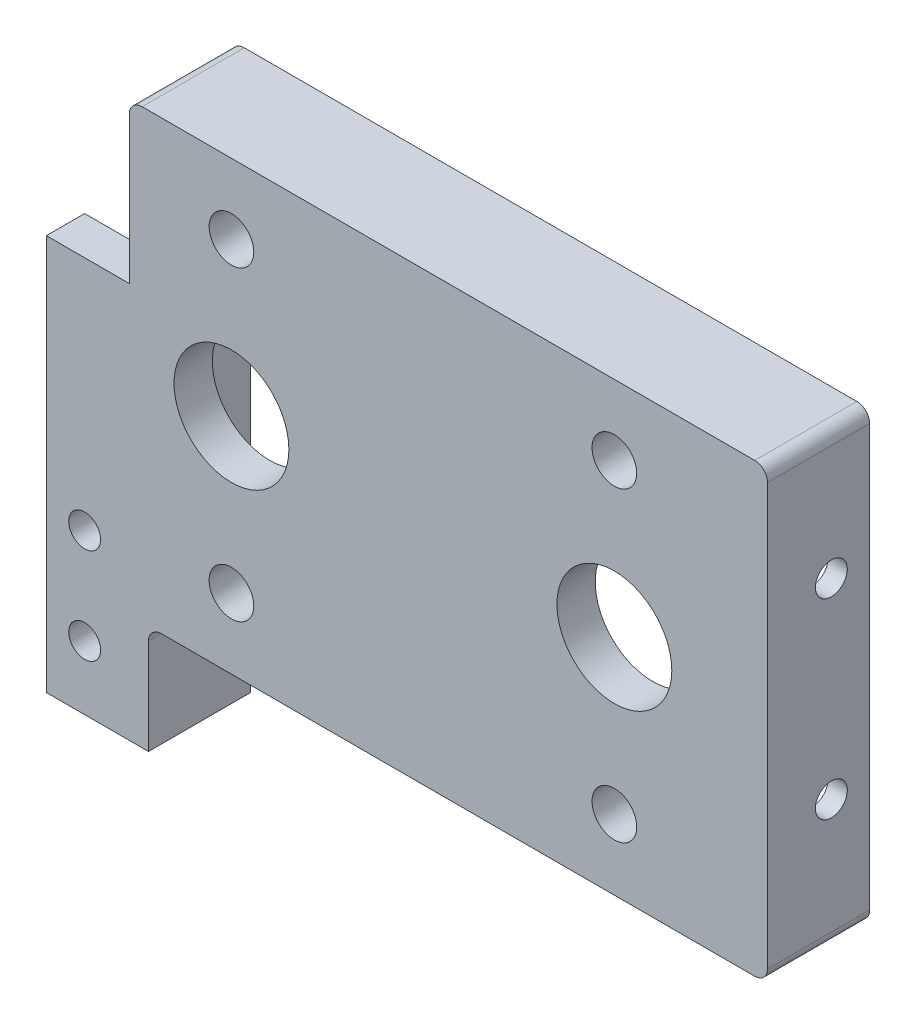
ISO-10303-21;
HEADER;
FILE_DESCRIPTION(('STEP AP214'),'2;1');
FILE_NAME('part.step','',(''),(''),'','','');
FILE_SCHEMA(('AUTOMOTIVE_DESIGN { 1 0 10303 214 1 1 1 1 }'));
ENDSEC;
DATA;
#1=APPLICATION_CONTEXT('core data for automotive mechanical design processes');
#2=APPLICATION_PROTOCOL_DEFINITION('international standard','automotive_design',2000,#1);
#3=PRODUCT_CONTEXT('',#1,'mechanical');
#4=PRODUCT('Part','Part','',(#3));
#5=PRODUCT_RELATED_PRODUCT_CATEGORY('part','',(#4));
#6=PRODUCT_DEFINITION_FORMATION('','',#4);
#7=PRODUCT_DEFINITION_CONTEXT('part definition',#1,'design');
#8=PRODUCT_DEFINITION('design','',#6,#7);
#9=PRODUCT_DEFINITION_SHAPE('','',#8);
#10=(LENGTH_UNIT() NAMED_UNIT(*) SI_UNIT(.MILLI.,.METRE.));
#11=(NAMED_UNIT(*) PLANE_ANGLE_UNIT() SI_UNIT($,.RADIAN.));
#12=(NAMED_UNIT(*) SI_UNIT($,.STERADIAN.) SOLID_ANGLE_UNIT());
#13=UNCERTAINTY_MEASURE_WITH_UNIT(LENGTH_MEASURE(1.E-05),#10,'distance_accuracy_value','');
#14=(GEOMETRIC_REPRESENTATION_CONTEXT(3) GLOBAL_UNCERTAINTY_ASSIGNED_CONTEXT((#13)) GLOBAL_UNIT_ASSIGNED_CONTEXT((#10,
#11,#12)) REPRESENTATION_CONTEXT('',''));
#15=CARTESIAN_POINT('',(0.,0.,0.));
#16=DIRECTION('',(0.,0.,1.));
#17=DIRECTION('',(1.,0.,0.));
#18=AXIS2_PLACEMENT_3D('',#15,#16,#17);
#19=CARTESIAN_POINT('',(-48.6575342465754,-47.7671232876712,-10.));
#20=DIRECTION('',(-1.,0.,0.));
#21=DIRECTION('',(0.,0.,1.));
#22=AXIS2_PLACEMENT_3D('',#19,#20,#21);
#23=PLANE('',#22);
#24=DIRECTION('',(0.,-1.,0.));
#25=VECTOR('',#24,1.);
#26=CARTESIAN_POINT('',(-48.6575342465754,-47.7671232876712,-10.));
#27=LINE('',#26,#25);
#28=CARTESIAN_POINT('',(-48.6575342465754,-52.7671232876713,-10.));
#29=VERTEX_POINT('',#28);
#30=CARTESIAN_POINT('',(-48.6575342465754,-67.7671232876712,-10.));
#31=VERTEX_POINT('',#30);
#32=EDGE_CURVE('E273',#29,#31,#27,.T.);
#33=ORIENTED_EDGE('',*,*,#32,.F.);
#34=DIRECTION('',(0.,0.,-1.));
#35=VECTOR('',#34,1.);
#36=CARTESIAN_POINT('',(-48.6575342465754,-52.7671232876713,6.));
#37=LINE('',#36,#35);
#38=CARTESIAN_POINT('',(-48.6575342465754,-52.7671232876713,6.));
#39=VERTEX_POINT('',#38);
#40=EDGE_CURVE('E403',#29,#39,#37,.F.);
#41=ORIENTED_EDGE('',*,*,#40,.T.);
#42=DIRECTION('',(0.,1.,0.));
#43=VECTOR('',#42,1.);
#44=CARTESIAN_POINT('',(-48.6575342465754,-67.7671232876712,6.));
#45=LINE('',#44,#43);
#46=CARTESIAN_POINT('',(-48.6575342465754,-67.7671232876712,6.));
#47=VERTEX_POINT('',#46);
#48=EDGE_CURVE('E263',#47,#39,#45,.T.);
#49=ORIENTED_EDGE('',*,*,#48,.F.);
#50=DIRECTION('',(0.,0.,1.));
#51=VECTOR('',#50,1.);
#52=CARTESIAN_POINT('',(-48.6575342465754,-67.7671232876712,-10.));
#53=LINE('',#52,#51);
#54=EDGE_CURVE('E297',#31,#47,#53,.T.);
#55=ORIENTED_EDGE('',*,*,#54,.F.);
#56=EDGE_LOOP('',(#33,#41,#49,#55));
#57=FACE_BOUND('',#56,.T.);
#58=ADVANCED_FACE('F39',(#57),#23,.F.);
#59=CARTESIAN_POINT('',(0.,0.,0.));
#60=DIRECTION('',(0.,0.,1.));
#61=DIRECTION('',(1.,0.,0.));
#62=AXIS2_PLACEMENT_3D('',#59,#60,#61);
#63=PLANE('',#62);
#64=CARTESIAN_POINT('',(-35.6575342465754,-15.7671232876712,0.));
#65=DIRECTION('',(0.,0.,1.));
#66=DIRECTION('',(1.,0.,0.));
#67=AXIS2_PLACEMENT_3D('',#64,#65,#66);
#68=CIRCLE('',#67,9.);
#69=CARTESIAN_POINT('',(-26.6575342465754,-15.7671232876712,0.));
#70=VERTEX_POINT('',#69);
#71=EDGE_CURVE('E326',#70,#70,#68,.T.);
#72=ORIENTED_EDGE('',*,*,#71,.T.);
#73=EDGE_LOOP('',(#72));
#74=FACE_BOUND('',#73,.T.);
#75=CARTESIAN_POINT('',(-35.6575342465754,8.23287671232875,0.));
#76=DIRECTION('',(0.,0.,1.));
#77=DIRECTION('',(1.,0.,0.));
#78=AXIS2_PLACEMENT_3D('',#75,#76,#77);
#79=CIRCLE('',#78,3.5);
#80=CARTESIAN_POINT('',(-32.1575342465754,8.23287671232875,0.));
#81=VERTEX_POINT('',#80);
#82=EDGE_CURVE('E342',#81,#81,#79,.T.);
#83=ORIENTED_EDGE('',*,*,#82,.T.);
#84=EDGE_LOOP('',(#83));
#85=FACE_BOUND('',#84,.T.);
#86=CARTESIAN_POINT('',(-35.6575342465749,-39.7671232876712,0.));
#87=DIRECTION('',(0.,0.,1.));
#88=DIRECTION('',(1.,0.,0.));
#89=AXIS2_PLACEMENT_3D('',#86,#87,#88);
#90=CIRCLE('',#89,3.5);
#91=CARTESIAN_POINT('',(-32.1575342465749,-39.7671232876712,0.));
#92=VERTEX_POINT('',#91);
#93=EDGE_CURVE('E332',#92,#92,#90,.T.);
#94=ORIENTED_EDGE('',*,*,#93,.T.);
#95=EDGE_LOOP('',(#94));
#96=FACE_BOUND('',#95,.T.);
#97=CARTESIAN_POINT('',(24.3424657534246,-15.7671232876712,0.));
#98=DIRECTION('',(0.,0.,1.));
#99=DIRECTION('',(1.,0.,0.));
#100=AXIS2_PLACEMENT_3D('',#97,#98,#99);
#101=CIRCLE('',#100,9.);
#102=CARTESIAN_POINT('',(33.3424657534246,-15.7671232876712,0.));
#103=VERTEX_POINT('',#102);
#104=EDGE_CURVE('E312',#103,#103,#101,.T.);
#105=ORIENTED_EDGE('',*,*,#104,.T.);
#106=EDGE_LOOP('',(#105));
#107=FACE_BOUND('',#106,.T.);
#108=CARTESIAN_POINT('',(24.3424657534246,8.23287671232875,0.));
#109=DIRECTION('',(0.,0.,1.));
#110=DIRECTION('',(1.,0.,0.));
#111=AXIS2_PLACEMENT_3D('',#108,#109,#110);
#112=CIRCLE('',#111,3.5);
#113=CARTESIAN_POINT('',(27.8424657534246,8.23287671232875,0.));
#114=VERTEX_POINT('',#113);
#115=EDGE_CURVE('E352',#114,#114,#112,.T.);
#116=ORIENTED_EDGE('',*,*,#115,.T.);
#117=EDGE_LOOP('',(#116));
#118=FACE_BOUND('',#117,.T.);
#119=CARTESIAN_POINT('',(24.3424657534251,-39.7671232876712,0.));
#120=DIRECTION('',(0.,0.,1.));
#121=DIRECTION('',(1.,0.,0.));
#122=AXIS2_PLACEMENT_3D('',#119,#120,#121);
#123=CIRCLE('',#122,3.5);
#124=CARTESIAN_POINT('',(27.8424657534251,-39.7671232876712,0.));
#125=VERTEX_POINT('',#124);
#126=EDGE_CURVE('E322',#125,#125,#123,.T.);
#127=ORIENTED_EDGE('',*,*,#126,.T.);
#128=EDGE_LOOP('',(#127));
#129=FACE_BOUND('',#128,.T.);
#130=DIRECTION('',(0.,-1.,0.));
#131=VECTOR('',#130,1.);
#132=CARTESIAN_POINT('',(-48.6575342465754,-47.7671232876712,0.));
#133=LINE('',#132,#131);
#134=CARTESIAN_POINT('',(-48.6575342465754,16.2328767123288,0.));
#135=VERTEX_POINT('',#134);
#136=CARTESIAN_POINT('',(-48.6575342465754,-47.7671232876712,0.));
#137=VERTEX_POINT('',#136);
#138=EDGE_CURVE('E267',#135,#137,#133,.T.);
#139=ORIENTED_EDGE('',*,*,#138,.F.);
#140=DIRECTION('',(-1.,0.,0.));
#141=VECTOR('',#140,1.);
#142=CARTESIAN_POINT('',(-54.6575342465754,16.2328767123288,0.));
#143=LINE('',#142,#141);
#144=CARTESIAN_POINT('',(45.3424657534246,16.2328767123288,0.));
#145=VERTEX_POINT('',#144);
#146=EDGE_CURVE('E286',#145,#135,#143,.T.);
#147=ORIENTED_EDGE('',*,*,#146,.F.);
#148=DIRECTION('',(0.,1.,0.));
#149=VECTOR('',#148,1.);
#150=CARTESIAN_POINT('',(45.3424657534246,16.2328767123288,0.));
#151=LINE('',#150,#149);
#152=CARTESIAN_POINT('',(45.3424657534246,-47.7671232876712,0.));
#153=VERTEX_POINT('',#152);
#154=EDGE_CURVE('E331',#153,#145,#151,.T.);
#155=ORIENTED_EDGE('',*,*,#154,.F.);
#156=DIRECTION('',(1.,0.,0.));
#157=VECTOR('',#156,1.);
#158=CARTESIAN_POINT('',(-54.6575342465754,-47.7671232876712,0.));
#159=LINE('',#158,#157);
#160=EDGE_CURVE('E327',#137,#153,#159,.T.);
#161=ORIENTED_EDGE('',*,*,#160,.F.);
#162=EDGE_LOOP('',(#139,#147,#155,#161));
#163=FACE_BOUND('',#162,.T.);
#164=ADVANCED_FACE('F484',(#74,#85,#96,#107,#118,#129,#163),#63,.F.);
#165=CARTESIAN_POINT('',(-58.6575342465754,-42.7671232876712,0.));
#166=DIRECTION('',(0.,0.,-1.));
#167=DIRECTION('',(-1.,0.,0.));
#168=AXIS2_PLACEMENT_3D('',#165,#166,#167);
#169=CIRCLE('',#168,2.5);
#170=CARTESIAN_POINT('',(-61.1575342465754,-42.7671232876712,0.));
#171=VERTEX_POINT('',#170);
#172=EDGE_CURVE('E363',#171,#171,#169,.T.);
#173=ORIENTED_EDGE('',*,*,#172,.F.);
#174=EDGE_LOOP('',(#173));
#175=FACE_BOUND('',#174,.T.);
#176=CARTESIAN_POINT('',(-58.6575342465754,-57.7671232876712,0.));
#177=DIRECTION('',(0.,0.,-1.));
#178=DIRECTION('',(-1.,0.,0.));
#179=AXIS2_PLACEMENT_3D('',#176,#177,#178);
#180=CIRCLE('',#179,2.5);
#181=CARTESIAN_POINT('',(-61.1575342465754,-57.7671232876712,0.));
#182=VERTEX_POINT('',#181);
#183=EDGE_CURVE('E197',#182,#182,#180,.T.);
#184=ORIENTED_EDGE('',*,*,#183,.F.);
#185=EDGE_LOOP('',(#184));
#186=FACE_BOUND('',#185,.T.);
#187=DIRECTION('',(1.,0.,0.));
#188=VECTOR('',#187,1.);
#189=CARTESIAN_POINT('',(-54.6575342465754,-67.7671232876712,0.));
#190=LINE('',#189,#188);
#191=CARTESIAN_POINT('',(-64.6575342465754,-67.7671232876712,0.));
#192=VERTEX_POINT('',#191);
#193=CARTESIAN_POINT('',(-51.6575342465754,-67.7671232876712,0.));
#194=VERTEX_POINT('',#193);
#195=EDGE_CURVE('E256',#192,#194,#190,.T.);
#196=ORIENTED_EDGE('',*,*,#195,.F.);
#197=DIRECTION('',(0.,-1.,0.));
#198=VECTOR('',#197,1.);
#199=CARTESIAN_POINT('',(-64.6575342465754,-5.76712328767124,0.));
#200=LINE('',#199,#198);
#201=CARTESIAN_POINT('',(-64.6575342465754,-5.76712328767124,0.));
#202=VERTEX_POINT('',#201);
#203=EDGE_CURVE('E186',#202,#192,#200,.T.);
#204=ORIENTED_EDGE('',*,*,#203,.F.);
#205=DIRECTION('',(-1.,0.,0.));
#206=VECTOR('',#205,1.);
#207=CARTESIAN_POINT('',(-51.6575342465754,-5.76712328767124,0.));
#208=LINE('',#207,#206);
#209=CARTESIAN_POINT('',(-51.6575342465754,-5.76712328767124,0.));
#210=VERTEX_POINT('',#209);
#211=EDGE_CURVE('E176',#210,#202,#208,.T.);
#212=ORIENTED_EDGE('',*,*,#211,.F.);
#213=DIRECTION('',(0.,1.,0.));
#214=VECTOR('',#213,1.);
#215=CARTESIAN_POINT('',(-51.6575342465754,-47.7671232876712,0.));
#216=LINE('',#215,#214);
#217=EDGE_CURVE('E281',#194,#210,#216,.T.);
#218=ORIENTED_EDGE('',*,*,#217,.F.);
#219=EDGE_LOOP('',(#196,#204,#212,#218));
#220=FACE_BOUND('',#219,.T.);
#221=ADVANCED_FACE('F457',(#175,#186,#220),#63,.F.);
#222=CARTESIAN_POINT('',(0.,0.,6.));
#223=DIRECTION('',(0.,0.,1.));
#224=DIRECTION('',(1.,0.,0.));
#225=AXIS2_PLACEMENT_3D('',#222,#223,#224);
#226=PLANE('',#225);
#227=CARTESIAN_POINT('',(-58.6575342465754,-42.7671232876712,6.));
#228=DIRECTION('',(0.,0.,1.));
#229=DIRECTION('',(1.,0.,0.));
#230=AXIS2_PLACEMENT_3D('',#227,#228,#229);
#231=CIRCLE('',#230,2.5);
#232=CARTESIAN_POINT('',(-56.1575342465754,-42.7671232876712,6.));
#233=VERTEX_POINT('',#232);
#234=EDGE_CURVE('E359',#233,#233,#231,.T.);
#235=ORIENTED_EDGE('',*,*,#234,.F.);
#236=EDGE_LOOP('',(#235));
#237=FACE_BOUND('',#236,.T.);
#238=CARTESIAN_POINT('',(-58.6575342465754,-57.7671232876712,6.));
#239=DIRECTION('',(0.,0.,1.));
#240=DIRECTION('',(1.,0.,0.));
#241=AXIS2_PLACEMENT_3D('',#238,#239,#240);
#242=CIRCLE('',#241,2.5);
#243=CARTESIAN_POINT('',(-56.1575342465754,-57.7671232876712,6.));
#244=VERTEX_POINT('',#243);
#245=EDGE_CURVE('E193',#244,#244,#242,.T.);
#246=ORIENTED_EDGE('',*,*,#245,.F.);
#247=EDGE_LOOP('',(#246));
#248=FACE_BOUND('',#247,.T.);
#249=DIRECTION('',(-1.,0.,0.));
#250=VECTOR('',#249,1.);
#251=CARTESIAN_POINT('',(45.3424657534246,19.2328767123288,6.));
#252=LINE('',#251,#250);
#253=CARTESIAN_POINT('',(46.3424657534246,19.2328767123288,6.));
#254=VERTEX_POINT('',#253);
#255=CARTESIAN_POINT('',(-49.6575342465753,19.2328767123288,6.));
#256=VERTEX_POINT('',#255);
#257=EDGE_CURVE('E218',#254,#256,#252,.T.);
#258=ORIENTED_EDGE('',*,*,#257,.T.);
#259=CARTESIAN_POINT('',(-49.6575342465754,17.2328767123288,6.));
#260=DIRECTION('',(0.,0.,1.));
#261=DIRECTION('',(1.,0.,0.));
#262=AXIS2_PLACEMENT_3D('',#259,#260,#261);
#263=CIRCLE('',#262,2.);
#264=CARTESIAN_POINT('',(-51.6575342465754,17.2328767123288,6.));
#265=VERTEX_POINT('',#264);
#266=EDGE_CURVE('E386',#256,#265,#263,.T.);
#267=ORIENTED_EDGE('',*,*,#266,.T.);
#268=DIRECTION('',(0.,1.,0.));
#269=VECTOR('',#268,1.);
#270=CARTESIAN_POINT('',(-51.6575342465754,16.2328767123288,6.));
#271=LINE('',#270,#269);
#272=CARTESIAN_POINT('',(-51.6575342465754,-5.76712328767124,6.));
#273=VERTEX_POINT('',#272);
#274=EDGE_CURVE('E171',#273,#265,#271,.T.);
#275=ORIENTED_EDGE('',*,*,#274,.F.);
#276=DIRECTION('',(-1.,0.,0.));
#277=VECTOR('',#276,1.);
#278=CARTESIAN_POINT('',(-51.6575342465754,-5.76712328767124,6.));
#279=LINE('',#278,#277);
#280=CARTESIAN_POINT('',(-64.6575342465754,-5.76712328767124,6.));
#281=VERTEX_POINT('',#280);
#282=EDGE_CURVE('E162',#273,#281,#279,.T.);
#283=ORIENTED_EDGE('',*,*,#282,.T.);
#284=DIRECTION('',(0.,1.,0.));
#285=VECTOR('',#284,1.);
#286=CARTESIAN_POINT('',(-64.6575342465754,-5.76712328767124,6.));
#287=LINE('',#286,#285);
#288=CARTESIAN_POINT('',(-64.6575342465754,-67.7671232876712,6.));
#289=VERTEX_POINT('',#288);
#290=EDGE_CURVE('E169',#289,#281,#287,.T.);
#291=ORIENTED_EDGE('',*,*,#290,.F.);
#292=DIRECTION('',(-1.,0.,0.));
#293=VECTOR('',#292,1.);
#294=CARTESIAN_POINT('',(-54.6575342465754,-67.7671232876712,6.));
#295=LINE('',#294,#293);
#296=EDGE_CURVE('E260',#47,#289,#295,.T.);
#297=ORIENTED_EDGE('',*,*,#296,.F.);
#298=ORIENTED_EDGE('',*,*,#48,.T.);
#299=CARTESIAN_POINT('',(-46.6575342465754,-52.7671232876713,6.));
#300=DIRECTION('',(0.,0.,1.));
#301=DIRECTION('',(1.,0.,0.));
#302=AXIS2_PLACEMENT_3D('',#299,#300,#301);
#303=CIRCLE('',#302,2.);
#304=CARTESIAN_POINT('',(-46.6575342465753,-50.7671232876713,6.));
#305=VERTEX_POINT('',#304);
#306=EDGE_CURVE('E11',#39,#305,#303,.F.);
#307=ORIENTED_EDGE('',*,*,#306,.T.);
#308=DIRECTION('',(-1.,0.,0.));
#309=VECTOR('',#308,1.);
#310=CARTESIAN_POINT('',(45.3424657534246,-50.7671232876713,6.));
#311=LINE('',#310,#309);
#312=CARTESIAN_POINT('',(46.3424657534246,-50.7671232876713,6.));
#313=VERTEX_POINT('',#312);
#314=EDGE_CURVE('E238',#313,#305,#311,.T.);
#315=ORIENTED_EDGE('',*,*,#314,.F.);
#316=CARTESIAN_POINT('',(46.3424657534246,-48.7671232876713,6.));
#317=DIRECTION('',(0.,0.,1.));
#318=DIRECTION('',(1.,0.,0.));
#319=AXIS2_PLACEMENT_3D('',#316,#317,#318);
#320=CIRCLE('',#319,2.);
#321=CARTESIAN_POINT('',(48.3424657534246,-48.7671232876713,6.));
#322=VERTEX_POINT('',#321);
#323=EDGE_CURVE('E57',#313,#322,#320,.T.);
#324=ORIENTED_EDGE('',*,*,#323,.T.);
#325=DIRECTION('',(0.,-1.,0.));
#326=VECTOR('',#325,1.);
#327=CARTESIAN_POINT('',(48.3424657534246,19.2328767123288,6.));
#328=LINE('',#327,#326);
#329=CARTESIAN_POINT('',(48.3424657534246,17.2328767123288,6.));
#330=VERTEX_POINT('',#329);
#331=EDGE_CURVE('E211',#330,#322,#328,.T.);
#332=ORIENTED_EDGE('',*,*,#331,.F.);
#333=CARTESIAN_POINT('',(46.3424657534246,17.2328767123288,6.));
#334=DIRECTION('',(0.,0.,1.));
#335=DIRECTION('',(1.,0.,0.));
#336=AXIS2_PLACEMENT_3D('',#333,#334,#335);
#337=CIRCLE('',#336,2.);
#338=EDGE_CURVE('E65',#330,#254,#337,.T.);
#339=ORIENTED_EDGE('',*,*,#338,.T.);
#340=EDGE_LOOP('',(#258,#267,#275,#283,#291,#297,#298,#307,#315,#324,#332,#339));
#341=FACE_BOUND('',#340,.T.);
#342=CARTESIAN_POINT('',(24.3424657534251,-39.7671232876712,6.));
#343=DIRECTION('',(0.,0.,1.));
#344=DIRECTION('',(1.,0.,0.));
#345=AXIS2_PLACEMENT_3D('',#342,#343,#344);
#346=CIRCLE('',#345,3.5);
#347=CARTESIAN_POINT('',(27.8424657534251,-39.7671232876712,6.));
#348=VERTEX_POINT('',#347);
#349=EDGE_CURVE('E300',#348,#348,#346,.T.);
#350=ORIENTED_EDGE('',*,*,#349,.F.);
#351=EDGE_LOOP('',(#350));
#352=FACE_BOUND('',#351,.T.);
#353=CARTESIAN_POINT('',(24.3424657534246,8.23287671232875,6.));
#354=DIRECTION('',(0.,0.,1.));
#355=DIRECTION('',(1.,0.,0.));
#356=AXIS2_PLACEMENT_3D('',#353,#354,#355);
#357=CIRCLE('',#356,3.5);
#358=CARTESIAN_POINT('',(27.8424657534246,8.23287671232875,6.));
#359=VERTEX_POINT('',#358);
#360=EDGE_CURVE('E301',#359,#359,#357,.T.);
#361=ORIENTED_EDGE('',*,*,#360,.F.);
#362=EDGE_LOOP('',(#361));
#363=FACE_BOUND('',#362,.T.);
#364=CARTESIAN_POINT('',(24.3424657534246,-15.7671232876712,6.));
#365=DIRECTION('',(0.,0.,1.));
#366=DIRECTION('',(1.,0.,0.));
#367=AXIS2_PLACEMENT_3D('',#364,#365,#366);
#368=CIRCLE('',#367,9.);
#369=CARTESIAN_POINT('',(33.3424657534246,-15.7671232876712,6.));
#370=VERTEX_POINT('',#369);
#371=EDGE_CURVE('E305',#370,#370,#368,.T.);
#372=ORIENTED_EDGE('',*,*,#371,.F.);
#373=EDGE_LOOP('',(#372));
#374=FACE_BOUND('',#373,.T.);
#375=CARTESIAN_POINT('',(-35.6575342465749,-39.7671232876712,6.));
#376=DIRECTION('',(0.,0.,1.));
#377=DIRECTION('',(1.,0.,0.));
#378=AXIS2_PLACEMENT_3D('',#375,#376,#377);
#379=CIRCLE('',#378,3.5);
#380=CARTESIAN_POINT('',(-32.1575342465749,-39.7671232876712,6.));
#381=VERTEX_POINT('',#380);
#382=EDGE_CURVE('E318',#381,#381,#379,.T.);
#383=ORIENTED_EDGE('',*,*,#382,.F.);
#384=EDGE_LOOP('',(#383));
#385=FACE_BOUND('',#384,.T.);
#386=CARTESIAN_POINT('',(-35.6575342465754,8.23287671232875,6.));
#387=DIRECTION('',(0.,0.,1.));
#388=DIRECTION('',(1.,0.,0.));
#389=AXIS2_PLACEMENT_3D('',#386,#387,#388);
#390=CIRCLE('',#389,3.5);
#391=CARTESIAN_POINT('',(-32.1575342465754,8.23287671232875,6.));
#392=VERTEX_POINT('',#391);
#393=EDGE_CURVE('E313',#392,#392,#390,.T.);
#394=ORIENTED_EDGE('',*,*,#393,.F.);
#395=EDGE_LOOP('',(#394));
#396=FACE_BOUND('',#395,.T.);
#397=CARTESIAN_POINT('',(-35.6575342465754,-15.7671232876712,6.));
#398=DIRECTION('',(0.,0.,1.));
#399=DIRECTION('',(1.,0.,0.));
#400=AXIS2_PLACEMENT_3D('',#397,#398,#399);
#401=CIRCLE('',#400,9.);
#402=CARTESIAN_POINT('',(-26.6575342465754,-15.7671232876712,6.));
#403=VERTEX_POINT('',#402);
#404=EDGE_CURVE('E317',#403,#403,#401,.T.);
#405=ORIENTED_EDGE('',*,*,#404,.F.);
#406=EDGE_LOOP('',(#405));
#407=FACE_BOUND('',#406,.T.);
#408=ADVANCED_FACE('F165',(#237,#248,#341,#352,#363,#374,#385,#396,#407),#226,.T.);
#409=CARTESIAN_POINT('',(-35.6575342465754,-15.7671232876712,-4.));
#410=DIRECTION('',(0.,0.,1.));
#411=DIRECTION('',(1.,0.,0.));
#412=AXIS2_PLACEMENT_3D('',#409,#410,#411);
#413=CYLINDRICAL_SURFACE('',#412,9.);
#414=ORIENTED_EDGE('',*,*,#404,.T.);
#415=EDGE_LOOP('',(#414));
#416=FACE_BOUND('',#415,.T.);
#417=ORIENTED_EDGE('',*,*,#71,.F.);
#418=EDGE_LOOP('',(#417));
#419=FACE_BOUND('',#418,.T.);
#420=ADVANCED_FACE('F617',(#416,#419),#413,.F.);
#421=CARTESIAN_POINT('',(-35.6575342465754,8.23287671232875,-4.));
#422=DIRECTION('',(0.,0.,1.));
#423=DIRECTION('',(1.,0.,0.));
#424=AXIS2_PLACEMENT_3D('',#421,#422,#423);
#425=CYLINDRICAL_SURFACE('',#424,3.5);
#426=ORIENTED_EDGE('',*,*,#393,.T.);
#427=EDGE_LOOP('',(#426));
#428=FACE_BOUND('',#427,.T.);
#429=ORIENTED_EDGE('',*,*,#82,.F.);
#430=EDGE_LOOP('',(#429));
#431=FACE_BOUND('',#430,.T.);
#432=ADVANCED_FACE('F702',(#428,#431),#425,.F.);
#433=CARTESIAN_POINT('',(-35.6575342465749,-39.7671232876712,-4.));
#434=DIRECTION('',(0.,0.,1.));
#435=DIRECTION('',(1.,0.,0.));
#436=AXIS2_PLACEMENT_3D('',#433,#434,#435);
#437=CYLINDRICAL_SURFACE('',#436,3.5);
#438=ORIENTED_EDGE('',*,*,#382,.T.);
#439=EDGE_LOOP('',(#438));
#440=FACE_BOUND('',#439,.T.);
#441=ORIENTED_EDGE('',*,*,#93,.F.);
#442=EDGE_LOOP('',(#441));
#443=FACE_BOUND('',#442,.T.);
#444=ADVANCED_FACE('F704',(#440,#443),#437,.F.);
#445=CARTESIAN_POINT('',(24.3424657534246,-15.7671232876712,-4.));
#446=DIRECTION('',(0.,0.,1.));
#447=DIRECTION('',(1.,0.,0.));
#448=AXIS2_PLACEMENT_3D('',#445,#446,#447);
#449=CYLINDRICAL_SURFACE('',#448,9.);
#450=ORIENTED_EDGE('',*,*,#371,.T.);
#451=EDGE_LOOP('',(#450));
#452=FACE_BOUND('',#451,.T.);
#453=ORIENTED_EDGE('',*,*,#104,.F.);
#454=EDGE_LOOP('',(#453));
#455=FACE_BOUND('',#454,.T.);
#456=ADVANCED_FACE('F707',(#452,#455),#449,.F.);
#457=CARTESIAN_POINT('',(24.3424657534246,8.23287671232875,-4.));
#458=DIRECTION('',(0.,0.,1.));
#459=DIRECTION('',(1.,0.,0.));
#460=AXIS2_PLACEMENT_3D('',#457,#458,#459);
#461=CYLINDRICAL_SURFACE('',#460,3.5);
#462=ORIENTED_EDGE('',*,*,#360,.T.);
#463=EDGE_LOOP('',(#462));
#464=FACE_BOUND('',#463,.T.);
#465=ORIENTED_EDGE('',*,*,#115,.F.);
#466=EDGE_LOOP('',(#465));
#467=FACE_BOUND('',#466,.T.);
#468=ADVANCED_FACE('F714',(#464,#467),#461,.F.);
#469=CARTESIAN_POINT('',(24.3424657534251,-39.7671232876712,-4.));
#470=DIRECTION('',(0.,0.,1.));
#471=DIRECTION('',(1.,0.,0.));
#472=AXIS2_PLACEMENT_3D('',#469,#470,#471);
#473=CYLINDRICAL_SURFACE('',#472,3.5);
#474=ORIENTED_EDGE('',*,*,#349,.T.);
#475=EDGE_LOOP('',(#474));
#476=FACE_BOUND('',#475,.T.);
#477=ORIENTED_EDGE('',*,*,#126,.F.);
#478=EDGE_LOOP('',(#477));
#479=FACE_BOUND('',#478,.T.);
#480=ADVANCED_FACE('F553',(#476,#479),#473,.F.);
#481=CARTESIAN_POINT('',(-48.6575342465754,-67.7671232876712,-10.));
#482=DIRECTION('',(0.,1.,0.));
#483=DIRECTION('',(0.,0.,1.));
#484=AXIS2_PLACEMENT_3D('',#481,#482,#483);
#485=PLANE('',#484);
#486=ORIENTED_EDGE('',*,*,#54,.T.);
#487=ORIENTED_EDGE('',*,*,#296,.T.);
#488=DIRECTION('',(0.,0.,1.));
#489=VECTOR('',#488,1.);
#490=CARTESIAN_POINT('',(-64.6575342465754,-67.7671232876712,6.));
#491=LINE('',#490,#489);
#492=EDGE_CURVE('E191',#192,#289,#491,.T.);
#493=ORIENTED_EDGE('',*,*,#492,.F.);
#494=ORIENTED_EDGE('',*,*,#195,.T.);
#495=DIRECTION('',(0.,0.,1.));
#496=VECTOR('',#495,1.);
#497=CARTESIAN_POINT('',(-51.6575342465754,-67.7671232876712,-10.));
#498=LINE('',#497,#496);
#499=CARTESIAN_POINT('',(-51.6575342465754,-67.7671232876712,-10.));
#500=VERTEX_POINT('',#499);
#501=EDGE_CURVE('E293',#500,#194,#498,.T.);
#502=ORIENTED_EDGE('',*,*,#501,.F.);
#503=DIRECTION('',(-1.,0.,0.));
#504=VECTOR('',#503,1.);
#505=CARTESIAN_POINT('',(-48.6575342465754,-67.7671232876712,-10.));
#506=LINE('',#505,#504);
#507=EDGE_CURVE('E272',#31,#500,#506,.T.);
#508=ORIENTED_EDGE('',*,*,#507,.F.);
#509=EDGE_LOOP('',(#486,#487,#493,#494,#502,#508));
#510=FACE_BOUND('',#509,.T.);
#511=ADVANCED_FACE('F459',(#510),#485,.F.);
#512=CARTESIAN_POINT('',(-51.6575342465754,-47.7671232876712,-10.));
#513=DIRECTION('',(1.,0.,0.));
#514=DIRECTION('',(0.,1.,0.));
#515=AXIS2_PLACEMENT_3D('',#512,#513,#514);
#516=PLANE('',#515);
#517=ORIENTED_EDGE('',*,*,#274,.T.);
#518=DIRECTION('',(0.,0.,-1.));
#519=VECTOR('',#518,1.);
#520=CARTESIAN_POINT('',(-51.6575342465754,17.2328767123288,-10.));
#521=LINE('',#520,#519);
#522=CARTESIAN_POINT('',(-51.6575342465753,17.2328767123287,-10.));
#523=VERTEX_POINT('',#522);
#524=EDGE_CURVE('E285',#265,#523,#521,.T.);
#525=ORIENTED_EDGE('',*,*,#524,.T.);
#526=DIRECTION('',(0.,1.,0.));
#527=VECTOR('',#526,1.);
#528=CARTESIAN_POINT('',(-51.6575342465754,-67.7671232876712,-10.));
#529=LINE('',#528,#527);
#530=EDGE_CURVE('E276',#500,#523,#529,.T.);
#531=ORIENTED_EDGE('',*,*,#530,.F.);
#532=ORIENTED_EDGE('',*,*,#501,.T.);
#533=ORIENTED_EDGE('',*,*,#217,.T.);
#534=DIRECTION('',(0.,0.,-1.));
#535=VECTOR('',#534,1.);
#536=CARTESIAN_POINT('',(-51.6575342465754,-5.76712328767124,6.));
#537=LINE('',#536,#535);
#538=EDGE_CURVE('E175',#273,#210,#537,.T.);
#539=ORIENTED_EDGE('',*,*,#538,.F.);
#540=EDGE_LOOP('',(#517,#525,#531,#532,#533,#539));
#541=FACE_BOUND('',#540,.T.);
#542=ADVANCED_FACE('F454',(#541),#516,.F.);
#543=ORIENTED_EDGE('',*,*,#138,.T.);
#544=DIRECTION('',(0.,0.,-1.));
#545=VECTOR('',#544,1.);
#546=CARTESIAN_POINT('',(-48.6575342465754,-47.7671232876712,-10.));
#547=LINE('',#546,#545);
#548=CARTESIAN_POINT('',(-48.6575342465754,-47.7671232876712,-10.));
#549=VERTEX_POINT('',#548);
#550=EDGE_CURVE('E247',#137,#549,#547,.T.);
#551=ORIENTED_EDGE('',*,*,#550,.T.);
#552=CARTESIAN_POINT('',(-48.6575342465754,16.2328767123288,-10.));
#553=VERTEX_POINT('',#552);
#554=EDGE_CURVE('E268',#553,#549,#27,.T.);
#555=ORIENTED_EDGE('',*,*,#554,.F.);
#556=DIRECTION('',(0.,0.,1.));
#557=VECTOR('',#556,1.);
#558=CARTESIAN_POINT('',(-48.6575342465754,16.2328767123288,-10.));
#559=LINE('',#558,#557);
#560=EDGE_CURVE('E280',#553,#135,#559,.T.);
#561=ORIENTED_EDGE('',*,*,#560,.T.);
#562=EDGE_LOOP('',(#543,#551,#555,#561));
#563=FACE_BOUND('',#562,.T.);
#564=ADVANCED_FACE('F486',(#563),#23,.F.);
#565=CARTESIAN_POINT('',(0.,0.,-10.));
#566=DIRECTION('',(0.,0.,-1.));
#567=DIRECTION('',(-1.,0.,0.));
#568=AXIS2_PLACEMENT_3D('',#565,#566,#567);
#569=PLANE('',#568);
#570=ORIENTED_EDGE('',*,*,#530,.T.);
#571=CARTESIAN_POINT('',(-49.6575342465754,17.2328767123288,-10.));
#572=DIRECTION('',(0.,0.,-1.));
#573=DIRECTION('',(-1.,0.,0.));
#574=AXIS2_PLACEMENT_3D('',#571,#572,#573);
#575=CIRCLE('',#574,2.);
#576=CARTESIAN_POINT('',(-49.6575342465753,19.2328767123288,-10.));
#577=VERTEX_POINT('',#576);
#578=EDGE_CURVE('E373',#523,#577,#575,.T.);
#579=ORIENTED_EDGE('',*,*,#578,.T.);
#580=DIRECTION('',(1.,0.,0.));
#581=VECTOR('',#580,1.);
#582=CARTESIAN_POINT('',(45.3424657534246,19.2328767123288,-10.));
#583=LINE('',#582,#581);
#584=CARTESIAN_POINT('',(46.3424657534246,19.2328767123288,-10.));
#585=VERTEX_POINT('',#584);
#586=EDGE_CURVE('E227',#577,#585,#583,.T.);
#587=ORIENTED_EDGE('',*,*,#586,.T.);
#588=CARTESIAN_POINT('',(46.3424657534246,17.2328767123288,-10.));
#589=DIRECTION('',(0.,0.,-1.));
#590=DIRECTION('',(-1.,0.,0.));
#591=AXIS2_PLACEMENT_3D('',#588,#589,#590);
#592=CIRCLE('',#591,2.);
#593=CARTESIAN_POINT('',(48.3424657534246,17.2328767123288,-10.));
#594=VERTEX_POINT('',#593);
#595=EDGE_CURVE('E370',#585,#594,#592,.T.);
#596=ORIENTED_EDGE('',*,*,#595,.T.);
#597=DIRECTION('',(0.,1.,0.));
#598=VECTOR('',#597,1.);
#599=CARTESIAN_POINT('',(48.3424657534246,19.2328767123288,-10.));
#600=LINE('',#599,#598);
#601=CARTESIAN_POINT('',(48.3424657534246,-48.7671232876713,-10.));
#602=VERTEX_POINT('',#601);
#603=EDGE_CURVE('E214',#602,#594,#600,.T.);
#604=ORIENTED_EDGE('',*,*,#603,.F.);
#605=CARTESIAN_POINT('',(46.3424657534246,-48.7671232876713,-10.));
#606=DIRECTION('',(0.,0.,-1.));
#607=DIRECTION('',(-1.,0.,0.));
#608=AXIS2_PLACEMENT_3D('',#605,#606,#607);
#609=CIRCLE('',#608,2.);
#610=CARTESIAN_POINT('',(46.3424657534246,-50.7671232876713,-10.));
#611=VERTEX_POINT('',#610);
#612=EDGE_CURVE('E367',#602,#611,#609,.T.);
#613=ORIENTED_EDGE('',*,*,#612,.T.);
#614=DIRECTION('',(1.,0.,0.));
#615=VECTOR('',#614,1.);
#616=CARTESIAN_POINT('',(45.3424657534246,-50.7671232876713,-10.));
#617=LINE('',#616,#615);
#618=CARTESIAN_POINT('',(-46.6575342465753,-50.7671232876713,-10.));
#619=VERTEX_POINT('',#618);
#620=EDGE_CURVE('E242',#619,#611,#617,.T.);
#621=ORIENTED_EDGE('',*,*,#620,.F.);
#622=CARTESIAN_POINT('',(-46.6575342465754,-52.7671232876713,-10.));
#623=DIRECTION('',(0.,0.,-1.));
#624=DIRECTION('',(-1.,0.,0.));
#625=AXIS2_PLACEMENT_3D('',#622,#623,#624);
#626=CIRCLE('',#625,2.);
#627=EDGE_CURVE('E49',#619,#29,#626,.F.);
#628=ORIENTED_EDGE('',*,*,#627,.T.);
#629=ORIENTED_EDGE('',*,*,#32,.T.);
#630=ORIENTED_EDGE('',*,*,#507,.T.);
#631=EDGE_LOOP('',(#570,#579,#587,#596,#604,#613,#621,#628,#629,#630));
#632=FACE_BOUND('',#631,.T.);
#633=ORIENTED_EDGE('',*,*,#554,.T.);
#634=DIRECTION('',(1.,0.,0.));
#635=VECTOR('',#634,1.);
#636=CARTESIAN_POINT('',(45.3424657534246,-47.7671232876712,-10.));
#637=LINE('',#636,#635);
#638=CARTESIAN_POINT('',(45.3424657534246,-47.7671232876712,-10.));
#639=VERTEX_POINT('',#638);
#640=EDGE_CURVE('E243',#549,#639,#637,.T.);
#641=ORIENTED_EDGE('',*,*,#640,.T.);
#642=DIRECTION('',(0.,1.,0.));
#643=VECTOR('',#642,1.);
#644=CARTESIAN_POINT('',(45.3424657534246,19.2328767123288,-10.));
#645=LINE('',#644,#643);
#646=CARTESIAN_POINT('',(45.3424657534246,16.2328767123288,-10.));
#647=VERTEX_POINT('',#646);
#648=EDGE_CURVE('E210',#639,#647,#645,.T.);
#649=ORIENTED_EDGE('',*,*,#648,.T.);
#650=DIRECTION('',(1.,0.,0.));
#651=VECTOR('',#650,1.);
#652=CARTESIAN_POINT('',(45.3424657534246,16.2328767123288,-10.));
#653=LINE('',#652,#651);
#654=EDGE_CURVE('E226',#553,#647,#653,.T.);
#655=ORIENTED_EDGE('',*,*,#654,.F.);
#656=EDGE_LOOP('',(#633,#641,#649,#655));
#657=FACE_BOUND('',#656,.T.);
#658=ADVANCED_FACE('F443',(#632,#657),#569,.T.);
#659=CARTESIAN_POINT('',(0.,-50.7671232876713,0.));
#660=DIRECTION('',(0.,1.,0.));
#661=DIRECTION('',(0.,0.,1.));
#662=AXIS2_PLACEMENT_3D('',#659,#660,#661);
#663=PLANE('',#662);
#664=ORIENTED_EDGE('',*,*,#314,.T.);
#665=DIRECTION('',(0.,0.,-1.));
#666=VECTOR('',#665,1.);
#667=CARTESIAN_POINT('',(-46.6575342465754,-50.7671232876713,-10.));
#668=LINE('',#667,#666);
#669=EDGE_CURVE('E399',#305,#619,#668,.T.);
#670=ORIENTED_EDGE('',*,*,#669,.T.);
#671=ORIENTED_EDGE('',*,*,#620,.T.);
#672=DIRECTION('',(0.,0.,-1.));
#673=VECTOR('',#672,1.);
#674=CARTESIAN_POINT('',(46.3424657534246,-50.7671232876713,6.));
#675=LINE('',#674,#673);
#676=EDGE_CURVE('E396',#611,#313,#675,.F.);
#677=ORIENTED_EDGE('',*,*,#676,.T.);
#678=EDGE_LOOP('',(#664,#670,#671,#677));
#679=FACE_BOUND('',#678,.T.);
#680=ADVANCED_FACE('F472',(#679),#663,.F.);
#681=CARTESIAN_POINT('',(0.,-47.7671232876712,0.));
#682=DIRECTION('',(0.,1.,0.));
#683=DIRECTION('',(0.,0.,1.));
#684=AXIS2_PLACEMENT_3D('',#681,#682,#683);
#685=PLANE('',#684);
#686=ORIENTED_EDGE('',*,*,#160,.T.);
#687=DIRECTION('',(0.,0.,1.));
#688=VECTOR('',#687,1.);
#689=CARTESIAN_POINT('',(45.3424657534246,-47.7671232876712,6.));
#690=LINE('',#689,#688);
#691=EDGE_CURVE('E237',#639,#153,#690,.T.);
#692=ORIENTED_EDGE('',*,*,#691,.F.);
#693=ORIENTED_EDGE('',*,*,#640,.F.);
#694=ORIENTED_EDGE('',*,*,#550,.F.);
#695=EDGE_LOOP('',(#686,#692,#693,#694));
#696=FACE_BOUND('',#695,.T.);
#697=ADVANCED_FACE('F507',(#696),#685,.T.);
#698=CARTESIAN_POINT('',(0.,16.2328767123288,0.));
#699=DIRECTION('',(0.,1.,0.));
#700=DIRECTION('',(0.,0.,1.));
#701=AXIS2_PLACEMENT_3D('',#698,#699,#700);
#702=PLANE('',#701);
#703=DIRECTION('',(0.,0.,1.));
#704=VECTOR('',#703,1.);
#705=CARTESIAN_POINT('',(45.3424657534246,16.2328767123288,6.));
#706=LINE('',#705,#704);
#707=EDGE_CURVE('E222',#647,#145,#706,.T.);
#708=ORIENTED_EDGE('',*,*,#707,.T.);
#709=ORIENTED_EDGE('',*,*,#146,.T.);
#710=ORIENTED_EDGE('',*,*,#560,.F.);
#711=ORIENTED_EDGE('',*,*,#654,.T.);
#712=EDGE_LOOP('',(#708,#709,#710,#711));
#713=FACE_BOUND('',#712,.T.);
#714=ADVANCED_FACE('F513',(#713),#702,.F.);
#715=CARTESIAN_POINT('',(0.,19.2328767123288,0.));
#716=DIRECTION('',(0.,1.,0.));
#717=DIRECTION('',(0.,0.,1.));
#718=AXIS2_PLACEMENT_3D('',#715,#716,#717);
#719=PLANE('',#718);
#720=ORIENTED_EDGE('',*,*,#586,.F.);
#721=DIRECTION('',(0.,0.,-1.));
#722=VECTOR('',#721,1.);
#723=CARTESIAN_POINT('',(-49.6575342465754,19.2328767123288,6.));
#724=LINE('',#723,#722);
#725=EDGE_CURVE('E379',#577,#256,#724,.F.);
#726=ORIENTED_EDGE('',*,*,#725,.T.);
#727=ORIENTED_EDGE('',*,*,#257,.F.);
#728=DIRECTION('',(0.,0.,1.));
#729=VECTOR('',#728,1.);
#730=CARTESIAN_POINT('',(46.3424657534246,19.2328767123288,0.));
#731=LINE('',#730,#729);
#732=EDGE_CURVE('E376',#254,#585,#731,.F.);
#733=ORIENTED_EDGE('',*,*,#732,.T.);
#734=EDGE_LOOP('',(#720,#726,#727,#733));
#735=FACE_BOUND('',#734,.T.);
#736=ADVANCED_FACE('F435',(#735),#719,.T.);
#737=CARTESIAN_POINT('',(48.3424657534246,0.,0.));
#738=DIRECTION('',(1.,0.,0.));
#739=DIRECTION('',(0.,1.,0.));
#740=AXIS2_PLACEMENT_3D('',#737,#738,#739);
#741=PLANE('',#740);
#742=CARTESIAN_POINT('',(48.3424657534246,-30.7671232876712,-4.));
#743=DIRECTION('',(1.,0.,0.));
#744=DIRECTION('',(0.,1.,0.));
#745=AXIS2_PLACEMENT_3D('',#742,#743,#744);
#746=CIRCLE('',#745,2.5);
#747=CARTESIAN_POINT('',(48.3424657534246,-28.2671232876712,-4.));
#748=VERTEX_POINT('',#747);
#749=EDGE_CURVE('E422',#748,#748,#746,.T.);
#750=ORIENTED_EDGE('',*,*,#749,.F.);
#751=EDGE_LOOP('',(#750));
#752=FACE_BOUND('',#751,.T.);
#753=CARTESIAN_POINT('',(48.3424657534246,-0.767123287671245,-4.));
#754=DIRECTION('',(1.,0.,0.));
#755=DIRECTION('',(0.,1.,0.));
#756=AXIS2_PLACEMENT_3D('',#753,#754,#755);
#757=CIRCLE('',#756,2.5);
#758=CARTESIAN_POINT('',(48.3424657534246,1.73287671232876,-4.));
#759=VERTEX_POINT('',#758);
#760=EDGE_CURVE('E410',#759,#759,#757,.T.);
#761=ORIENTED_EDGE('',*,*,#760,.F.);
#762=EDGE_LOOP('',(#761));
#763=FACE_BOUND('',#762,.T.);
#764=ORIENTED_EDGE('',*,*,#603,.T.);
#765=DIRECTION('',(0.,0.,1.));
#766=VECTOR('',#765,1.);
#767=CARTESIAN_POINT('',(48.3424657534246,17.2328767123288,0.));
#768=LINE('',#767,#766);
#769=EDGE_CURVE('E393',#594,#330,#768,.T.);
#770=ORIENTED_EDGE('',*,*,#769,.T.);
#771=ORIENTED_EDGE('',*,*,#331,.T.);
#772=DIRECTION('',(0.,0.,-1.));
#773=VECTOR('',#772,1.);
#774=CARTESIAN_POINT('',(48.3424657534246,-48.7671232876713,-10.));
#775=LINE('',#774,#773);
#776=EDGE_CURVE('E389',#322,#602,#775,.T.);
#777=ORIENTED_EDGE('',*,*,#776,.T.);
#778=EDGE_LOOP('',(#764,#770,#771,#777));
#779=FACE_BOUND('',#778,.T.);
#780=ADVANCED_FACE('F431',(#752,#763,#779),#741,.T.);
#781=CARTESIAN_POINT('',(45.3424657534246,0.,0.));
#782=DIRECTION('',(1.,0.,0.));
#783=DIRECTION('',(0.,1.,0.));
#784=AXIS2_PLACEMENT_3D('',#781,#782,#783);
#785=PLANE('',#784);
#786=CARTESIAN_POINT('',(45.3424657534246,-30.7671232876712,-4.));
#787=DIRECTION('',(1.,0.,0.));
#788=DIRECTION('',(0.,1.,0.));
#789=AXIS2_PLACEMENT_3D('',#786,#787,#788);
#790=CIRCLE('',#789,2.5);
#791=CARTESIAN_POINT('',(45.3424657534246,-28.2671232876712,-4.));
#792=VERTEX_POINT('',#791);
#793=EDGE_CURVE('E43',#792,#792,#790,.T.);
#794=ORIENTED_EDGE('',*,*,#793,.T.);
#795=EDGE_LOOP('',(#794));
#796=FACE_BOUND('',#795,.T.);
#797=CARTESIAN_POINT('',(45.3424657534246,-0.767123287671245,-4.));
#798=DIRECTION('',(1.,0.,0.));
#799=DIRECTION('',(0.,1.,0.));
#800=AXIS2_PLACEMENT_3D('',#797,#798,#799);
#801=CIRCLE('',#800,2.5);
#802=CARTESIAN_POINT('',(45.3424657534246,1.73287671232875,-4.));
#803=VERTEX_POINT('',#802);
#804=EDGE_CURVE('E407',#803,#803,#801,.T.);
#805=ORIENTED_EDGE('',*,*,#804,.T.);
#806=EDGE_LOOP('',(#805));
#807=FACE_BOUND('',#806,.T.);
#808=ORIENTED_EDGE('',*,*,#707,.F.);
#809=ORIENTED_EDGE('',*,*,#648,.F.);
#810=ORIENTED_EDGE('',*,*,#691,.T.);
#811=ORIENTED_EDGE('',*,*,#154,.T.);
#812=EDGE_LOOP('',(#808,#809,#810,#811));
#813=FACE_BOUND('',#812,.T.);
#814=ADVANCED_FACE('F434',(#796,#807,#813),#785,.F.);
#815=CARTESIAN_POINT('',(-51.6575342465754,-5.76712328767124,6.));
#816=DIRECTION('',(0.,-1.,0.));
#817=DIRECTION('',(0.,0.,-1.));
#818=AXIS2_PLACEMENT_3D('',#815,#816,#817);
#819=PLANE('',#818);
#820=ORIENTED_EDGE('',*,*,#282,.F.);
#821=ORIENTED_EDGE('',*,*,#538,.T.);
#822=ORIENTED_EDGE('',*,*,#211,.T.);
#823=DIRECTION('',(0.,0.,-1.));
#824=VECTOR('',#823,1.);
#825=CARTESIAN_POINT('',(-64.6575342465754,-5.76712328767124,6.));
#826=LINE('',#825,#824);
#827=EDGE_CURVE('E179',#281,#202,#826,.T.);
#828=ORIENTED_EDGE('',*,*,#827,.F.);
#829=EDGE_LOOP('',(#820,#821,#822,#828));
#830=FACE_BOUND('',#829,.T.);
#831=ADVANCED_FACE('F180',(#830),#819,.F.);
#832=CARTESIAN_POINT('',(-64.6575342465754,0.,0.));
#833=DIRECTION('',(1.,0.,0.));
#834=DIRECTION('',(0.,1.,0.));
#835=AXIS2_PLACEMENT_3D('',#832,#833,#834);
#836=PLANE('',#835);
#837=ORIENTED_EDGE('',*,*,#290,.T.);
#838=ORIENTED_EDGE('',*,*,#827,.T.);
#839=ORIENTED_EDGE('',*,*,#203,.T.);
#840=ORIENTED_EDGE('',*,*,#492,.T.);
#841=EDGE_LOOP('',(#837,#838,#839,#840));
#842=FACE_BOUND('',#841,.T.);
#843=ADVANCED_FACE('F189',(#842),#836,.F.);
#844=CARTESIAN_POINT('',(-58.6575342465754,-57.7671232876712,10.));
#845=DIRECTION('',(0.,0.,-1.));
#846=DIRECTION('',(-1.,0.,0.));
#847=AXIS2_PLACEMENT_3D('',#844,#845,#846);
#848=CYLINDRICAL_SURFACE('',#847,2.5);
#849=ORIENTED_EDGE('',*,*,#245,.T.);
#850=EDGE_LOOP('',(#849));
#851=FACE_BOUND('',#850,.T.);
#852=ORIENTED_EDGE('',*,*,#183,.T.);
#853=EDGE_LOOP('',(#852));
#854=FACE_BOUND('',#853,.T.);
#855=ADVANCED_FACE('F575',(#851,#854),#848,.F.);
#856=CARTESIAN_POINT('',(-58.6575342465754,-42.7671232876712,10.));
#857=DIRECTION('',(0.,0.,-1.));
#858=DIRECTION('',(-1.,0.,0.));
#859=AXIS2_PLACEMENT_3D('',#856,#857,#858);
#860=CYLINDRICAL_SURFACE('',#859,2.5);
#861=ORIENTED_EDGE('',*,*,#234,.T.);
#862=EDGE_LOOP('',(#861));
#863=FACE_BOUND('',#862,.T.);
#864=ORIENTED_EDGE('',*,*,#172,.T.);
#865=EDGE_LOOP('',(#864));
#866=FACE_BOUND('',#865,.T.);
#867=ADVANCED_FACE('F584',(#863,#866),#860,.F.);
#868=CARTESIAN_POINT('',(-49.6575342465754,17.2328767123288,-10.));
#869=DIRECTION('',(0.,0.,1.));
#870=DIRECTION('',(1.,0.,0.));
#871=AXIS2_PLACEMENT_3D('',#868,#869,#870);
#872=CYLINDRICAL_SURFACE('',#871,2.);
#873=ORIENTED_EDGE('',*,*,#266,.F.);
#874=ORIENTED_EDGE('',*,*,#725,.F.);
#875=ORIENTED_EDGE('',*,*,#578,.F.);
#876=ORIENTED_EDGE('',*,*,#524,.F.);
#877=EDGE_LOOP('',(#873,#874,#875,#876));
#878=FACE_BOUND('',#877,.T.);
#879=ADVANCED_FACE('F451',(#878),#872,.T.);
#880=CARTESIAN_POINT('',(46.3424657534246,17.2328767123288,0.));
#881=DIRECTION('',(0.,0.,1.));
#882=DIRECTION('',(1.,0.,0.));
#883=AXIS2_PLACEMENT_3D('',#880,#881,#882);
#884=CYLINDRICAL_SURFACE('',#883,2.);
#885=ORIENTED_EDGE('',*,*,#595,.F.);
#886=ORIENTED_EDGE('',*,*,#732,.F.);
#887=ORIENTED_EDGE('',*,*,#338,.F.);
#888=ORIENTED_EDGE('',*,*,#769,.F.);
#889=EDGE_LOOP('',(#885,#886,#887,#888));
#890=FACE_BOUND('',#889,.T.);
#891=ADVANCED_FACE('F442',(#890),#884,.T.);
#892=CARTESIAN_POINT('',(-46.6575342465754,-52.7671232876713,0.));
#893=DIRECTION('',(0.,0.,1.));
#894=DIRECTION('',(1.,0.,0.));
#895=AXIS2_PLACEMENT_3D('',#892,#893,#894);
#896=CYLINDRICAL_SURFACE('',#895,2.);
#897=ORIENTED_EDGE('',*,*,#306,.F.);
#898=ORIENTED_EDGE('',*,*,#40,.F.);
#899=ORIENTED_EDGE('',*,*,#627,.F.);
#900=ORIENTED_EDGE('',*,*,#669,.F.);
#901=EDGE_LOOP('',(#897,#898,#899,#900));
#902=FACE_BOUND('',#901,.T.);
#903=ADVANCED_FACE('F469',(#902),#896,.F.);
#904=CARTESIAN_POINT('',(46.3424657534246,-48.7671232876713,0.));
#905=DIRECTION('',(0.,0.,1.));
#906=DIRECTION('',(1.,0.,0.));
#907=AXIS2_PLACEMENT_3D('',#904,#905,#906);
#908=CYLINDRICAL_SURFACE('',#907,2.);
#909=ORIENTED_EDGE('',*,*,#323,.F.);
#910=ORIENTED_EDGE('',*,*,#676,.F.);
#911=ORIENTED_EDGE('',*,*,#612,.F.);
#912=ORIENTED_EDGE('',*,*,#776,.F.);
#913=EDGE_LOOP('',(#909,#910,#911,#912));
#914=FACE_BOUND('',#913,.T.);
#915=ADVANCED_FACE('F41',(#914),#908,.T.);
#916=CARTESIAN_POINT('',(38.3424657534246,-0.767123287671246,-4.));
#917=DIRECTION('',(1.,0.,0.));
#918=DIRECTION('',(0.,1.,0.));
#919=AXIS2_PLACEMENT_3D('',#916,#917,#918);
#920=CYLINDRICAL_SURFACE('',#919,2.5);
#921=ORIENTED_EDGE('',*,*,#760,.T.);
#922=EDGE_LOOP('',(#921));
#923=FACE_BOUND('',#922,.T.);
#924=ORIENTED_EDGE('',*,*,#804,.F.);
#925=EDGE_LOOP('',(#924));
#926=FACE_BOUND('',#925,.T.);
#927=ADVANCED_FACE('F477',(#923,#926),#920,.F.);
#928=CARTESIAN_POINT('',(38.3424657534246,-30.7671232876712,-4.));
#929=DIRECTION('',(1.,0.,0.));
#930=DIRECTION('',(0.,1.,0.));
#931=AXIS2_PLACEMENT_3D('',#928,#929,#930);
#932=CYLINDRICAL_SURFACE('',#931,2.5);
#933=ORIENTED_EDGE('',*,*,#749,.T.);
#934=EDGE_LOOP('',(#933));
#935=FACE_BOUND('',#934,.T.);
#936=ORIENTED_EDGE('',*,*,#793,.F.);
#937=EDGE_LOOP('',(#936));
#938=FACE_BOUND('',#937,.T.);
#939=ADVANCED_FACE('F428',(#935,#938),#932,.F.);
#940=CLOSED_SHELL('',(#58,#164,#221,#408,#420,#432,#444,#456,#468,#480,#511,#542,#564,#658,#680,
#697,#714,#736,#780,#814,#831,#843,#855,#867,#879,#891,#903,#915,#927,#939));
#941=MANIFOLD_SOLID_BREP('B2',#940);
#942=ADVANCED_BREP_SHAPE_REPRESENTATION('',(#18,#941),#14);
#943=SHAPE_DEFINITION_REPRESENTATION(#9,#942);
ENDSEC;
END-ISO-10303-21;
